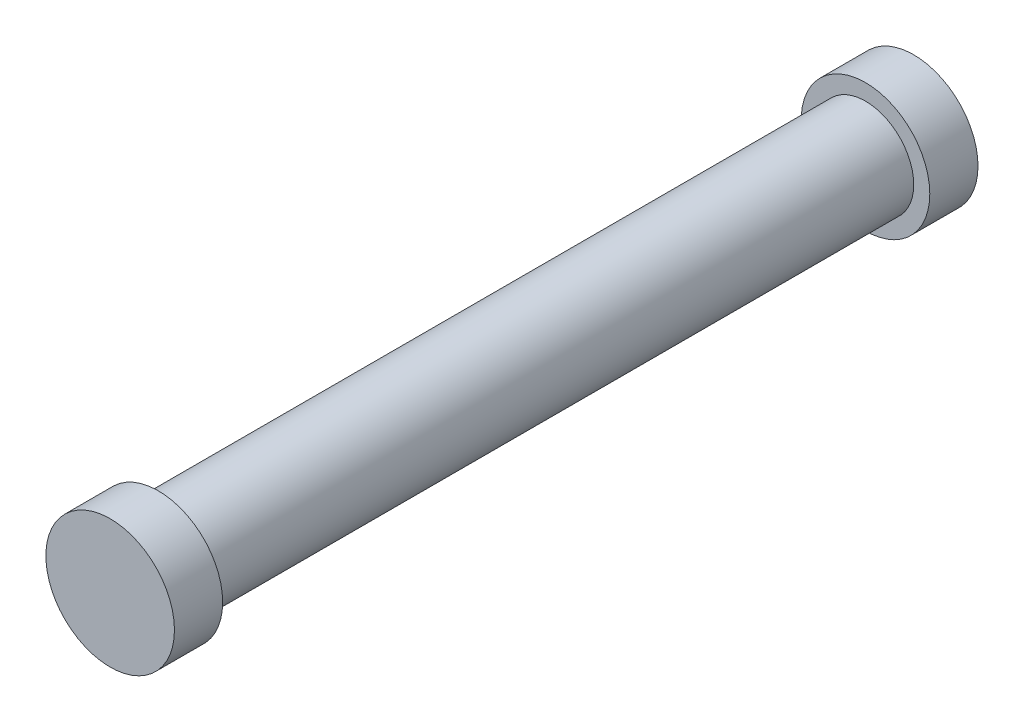
ISO-10303-21;
HEADER;
FILE_DESCRIPTION(('STEP AP214'),'2;1');
FILE_NAME('part.step','',(''),(''),'','','');
FILE_SCHEMA(('AUTOMOTIVE_DESIGN { 1 0 10303 214 1 1 1 1 }'));
ENDSEC;
DATA;
#1=APPLICATION_CONTEXT('core data for automotive mechanical design processes');
#2=APPLICATION_PROTOCOL_DEFINITION('international standard','automotive_design',2000,#1);
#3=PRODUCT_CONTEXT('',#1,'mechanical');
#4=PRODUCT('Part','Part','',(#3));
#5=PRODUCT_RELATED_PRODUCT_CATEGORY('part','',(#4));
#6=PRODUCT_DEFINITION_FORMATION('','',#4);
#7=PRODUCT_DEFINITION_CONTEXT('part definition',#1,'design');
#8=PRODUCT_DEFINITION('design','',#6,#7);
#9=PRODUCT_DEFINITION_SHAPE('','',#8);
#10=(LENGTH_UNIT() NAMED_UNIT(*) SI_UNIT(.MILLI.,.METRE.));
#11=(NAMED_UNIT(*) PLANE_ANGLE_UNIT() SI_UNIT($,.RADIAN.));
#12=(NAMED_UNIT(*) SI_UNIT($,.STERADIAN.) SOLID_ANGLE_UNIT());
#13=UNCERTAINTY_MEASURE_WITH_UNIT(LENGTH_MEASURE(1.E-05),#10,'distance_accuracy_value','');
#14=(GEOMETRIC_REPRESENTATION_CONTEXT(3) GLOBAL_UNCERTAINTY_ASSIGNED_CONTEXT((#13)) GLOBAL_UNIT_ASSIGNED_CONTEXT((#10,
#11,#12)) REPRESENTATION_CONTEXT('',''));
#15=CARTESIAN_POINT('',(0.,0.,0.));
#16=DIRECTION('',(0.,0.,1.));
#17=DIRECTION('',(1.,0.,0.));
#18=AXIS2_PLACEMENT_3D('',#15,#16,#17);
#19=CARTESIAN_POINT('',(0.,0.,19.05));
#20=DIRECTION('',(0.,0.,-1.));
#21=DIRECTION('',(-1.,0.,0.));
#22=AXIS2_PLACEMENT_3D('',#19,#20,#21);
#23=CYLINDRICAL_SURFACE('',#22,25.4);
#24=CARTESIAN_POINT('',(0.,0.,19.05));
#25=DIRECTION('',(0.,0.,1.));
#26=DIRECTION('',(1.,0.,0.));
#27=AXIS2_PLACEMENT_3D('',#24,#25,#26);
#28=CIRCLE('',#27,25.4);
#29=CARTESIAN_POINT('',(25.4,0.,19.05));
#30=VERTEX_POINT('',#29);
#31=EDGE_CURVE('E10',#30,#30,#28,.T.);
#32=ORIENTED_EDGE('',*,*,#31,.F.);
#33=EDGE_LOOP('',(#32));
#34=FACE_BOUND('',#33,.T.);
#35=CARTESIAN_POINT('',(0.,0.,0.));
#36=DIRECTION('',(0.,0.,1.));
#37=DIRECTION('',(1.,0.,0.));
#38=AXIS2_PLACEMENT_3D('',#35,#36,#37);
#39=CIRCLE('',#38,25.4);
#40=CARTESIAN_POINT('',(25.4,0.,0.));
#41=VERTEX_POINT('',#40);
#42=EDGE_CURVE('E34',#41,#41,#39,.T.);
#43=ORIENTED_EDGE('',*,*,#42,.T.);
#44=EDGE_LOOP('',(#43));
#45=FACE_BOUND('',#44,.T.);
#46=ADVANCED_FACE('F31',(#34,#45),#23,.T.);
#47=CARTESIAN_POINT('',(0.,0.,19.05));
#48=DIRECTION('',(0.,0.,1.));
#49=DIRECTION('',(1.,0.,0.));
#50=AXIS2_PLACEMENT_3D('',#47,#48,#49);
#51=PLANE('',#50);
#52=CARTESIAN_POINT('',(0.,0.,19.05));
#53=DIRECTION('',(0.,0.,1.));
#54=DIRECTION('',(1.,0.,0.));
#55=AXIS2_PLACEMENT_3D('',#52,#53,#54);
#56=CIRCLE('',#55,19.05);
#57=CARTESIAN_POINT('',(19.05,0.,19.05));
#58=VERTEX_POINT('',#57);
#59=EDGE_CURVE('E43',#58,#58,#56,.T.);
#60=ORIENTED_EDGE('',*,*,#59,.F.);
#61=EDGE_LOOP('',(#60));
#62=FACE_BOUND('',#61,.T.);
#63=ORIENTED_EDGE('',*,*,#31,.T.);
#64=EDGE_LOOP('',(#63));
#65=FACE_BOUND('',#64,.T.);
#66=ADVANCED_FACE('F73',(#62,#65),#51,.T.);
#67=CARTESIAN_POINT('',(0.,0.,0.));
#68=DIRECTION('',(0.,0.,1.));
#69=DIRECTION('',(1.,0.,0.));
#70=AXIS2_PLACEMENT_3D('',#67,#68,#69);
#71=PLANE('',#70);
#72=ORIENTED_EDGE('',*,*,#42,.F.);
#73=EDGE_LOOP('',(#72));
#74=FACE_BOUND('',#73,.T.);
#75=ADVANCED_FACE('F78',(#74),#71,.F.);
#76=CARTESIAN_POINT('',(0.,0.,298.45));
#77=DIRECTION('',(0.,0.,-1.));
#78=DIRECTION('',(-1.,0.,0.));
#79=AXIS2_PLACEMENT_3D('',#76,#77,#78);
#80=CYLINDRICAL_SURFACE('',#79,19.05);
#81=CARTESIAN_POINT('',(0.,0.,298.45));
#82=DIRECTION('',(0.,0.,1.));
#83=DIRECTION('',(1.,0.,0.));
#84=AXIS2_PLACEMENT_3D('',#81,#82,#83);
#85=CIRCLE('',#84,19.05);
#86=CARTESIAN_POINT('',(19.05,0.,298.45));
#87=VERTEX_POINT('',#86);
#88=EDGE_CURVE('E41',#87,#87,#85,.T.);
#89=ORIENTED_EDGE('',*,*,#88,.F.);
#90=EDGE_LOOP('',(#89));
#91=FACE_BOUND('',#90,.T.);
#92=ORIENTED_EDGE('',*,*,#59,.T.);
#93=EDGE_LOOP('',(#92));
#94=FACE_BOUND('',#93,.T.);
#95=ADVANCED_FACE('F60',(#91,#94),#80,.T.);
#96=CARTESIAN_POINT('',(0.,0.,317.5));
#97=DIRECTION('',(0.,0.,-1.));
#98=DIRECTION('',(-1.,0.,0.));
#99=AXIS2_PLACEMENT_3D('',#96,#97,#98);
#100=CYLINDRICAL_SURFACE('',#99,25.4);
#101=CARTESIAN_POINT('',(0.,0.,317.5));
#102=DIRECTION('',(0.,0.,1.));
#103=DIRECTION('',(1.,0.,0.));
#104=AXIS2_PLACEMENT_3D('',#101,#102,#103);
#105=CIRCLE('',#104,25.4);
#106=CARTESIAN_POINT('',(25.4,0.,317.5));
#107=VERTEX_POINT('',#106);
#108=EDGE_CURVE('E46',#107,#107,#105,.T.);
#109=ORIENTED_EDGE('',*,*,#108,.F.);
#110=EDGE_LOOP('',(#109));
#111=FACE_BOUND('',#110,.T.);
#112=CARTESIAN_POINT('',(0.,0.,298.45));
#113=DIRECTION('',(0.,0.,1.));
#114=DIRECTION('',(1.,0.,0.));
#115=AXIS2_PLACEMENT_3D('',#112,#113,#114);
#116=CIRCLE('',#115,25.4);
#117=CARTESIAN_POINT('',(25.4,0.,298.45));
#118=VERTEX_POINT('',#117);
#119=EDGE_CURVE('E49',#118,#118,#116,.T.);
#120=ORIENTED_EDGE('',*,*,#119,.T.);
#121=EDGE_LOOP('',(#120));
#122=FACE_BOUND('',#121,.T.);
#123=ADVANCED_FACE('F57',(#111,#122),#100,.T.);
#124=CARTESIAN_POINT('',(0.,0.,317.5));
#125=DIRECTION('',(0.,0.,1.));
#126=DIRECTION('',(1.,0.,0.));
#127=AXIS2_PLACEMENT_3D('',#124,#125,#126);
#128=PLANE('',#127);
#129=ORIENTED_EDGE('',*,*,#108,.T.);
#130=EDGE_LOOP('',(#129));
#131=FACE_BOUND('',#130,.T.);
#132=ADVANCED_FACE('F55',(#131),#128,.T.);
#133=CARTESIAN_POINT('',(0.,0.,298.45));
#134=DIRECTION('',(0.,0.,1.));
#135=DIRECTION('',(1.,0.,0.));
#136=AXIS2_PLACEMENT_3D('',#133,#134,#135);
#137=PLANE('',#136);
#138=ORIENTED_EDGE('',*,*,#88,.T.);
#139=EDGE_LOOP('',(#138));
#140=FACE_BOUND('',#139,.T.);
#141=ORIENTED_EDGE('',*,*,#119,.F.);
#142=EDGE_LOOP('',(#141));
#143=FACE_BOUND('',#142,.T.);
#144=ADVANCED_FACE('F64',(#140,#143),#137,.F.);
#145=CLOSED_SHELL('',(#46,#66,#75,#95,#123,#132,#144));
#146=MANIFOLD_SOLID_BREP('B2',#145);
#147=ADVANCED_BREP_SHAPE_REPRESENTATION('',(#18,#146),#14);
#148=SHAPE_DEFINITION_REPRESENTATION(#9,#147);
ENDSEC;
END-ISO-10303-21;
